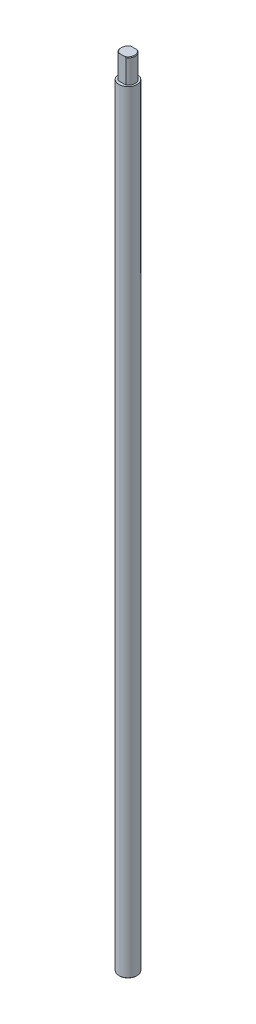
ISO-10303-21;
HEADER;
FILE_DESCRIPTION(('STEP AP214'),'2;1');
FILE_NAME('part.step','',(''),(''),'','','');
FILE_SCHEMA(('AUTOMOTIVE_DESIGN { 1 0 10303 214 1 1 1 1 }'));
ENDSEC;
DATA;
#1=APPLICATION_CONTEXT('core data for automotive mechanical design processes');
#2=APPLICATION_PROTOCOL_DEFINITION('international standard','automotive_design',2000,#1);
#3=PRODUCT_CONTEXT('',#1,'mechanical');
#4=PRODUCT('Part','Part','',(#3));
#5=PRODUCT_RELATED_PRODUCT_CATEGORY('part','',(#4));
#6=PRODUCT_DEFINITION_FORMATION('','',#4);
#7=PRODUCT_DEFINITION_CONTEXT('part definition',#1,'design');
#8=PRODUCT_DEFINITION('design','',#6,#7);
#9=PRODUCT_DEFINITION_SHAPE('','',#8);
#10=(LENGTH_UNIT() NAMED_UNIT(*) SI_UNIT(.MILLI.,.METRE.));
#11=(NAMED_UNIT(*) PLANE_ANGLE_UNIT() SI_UNIT($,.RADIAN.));
#12=(NAMED_UNIT(*) SI_UNIT($,.STERADIAN.) SOLID_ANGLE_UNIT());
#13=UNCERTAINTY_MEASURE_WITH_UNIT(LENGTH_MEASURE(1.E-05),#10,'distance_accuracy_value','');
#14=(GEOMETRIC_REPRESENTATION_CONTEXT(3) GLOBAL_UNCERTAINTY_ASSIGNED_CONTEXT((#13)) GLOBAL_UNIT_ASSIGNED_CONTEXT((#10,
#11,#12)) REPRESENTATION_CONTEXT('',''));
#15=CARTESIAN_POINT('',(0.,0.,0.));
#16=DIRECTION('',(0.,0.,1.));
#17=DIRECTION('',(1.,0.,0.));
#18=AXIS2_PLACEMENT_3D('',#15,#16,#17);
#19=CARTESIAN_POINT('',(0.,660.,0.));
#20=DIRECTION('',(0.,-1.,0.));
#21=DIRECTION('',(0.,0.,-1.));
#22=AXIS2_PLACEMENT_3D('',#19,#20,#21);
#23=CYLINDRICAL_SURFACE('',#22,6.);
#24=CARTESIAN_POINT('',(0.,659.5,0.));
#25=DIRECTION('',(0.,1.,0.));
#26=DIRECTION('',(0.,0.,1.));
#27=AXIS2_PLACEMENT_3D('',#24,#25,#26);
#28=CIRCLE('',#27,6.);
#29=CARTESIAN_POINT('',(3.3166247903554,659.5,-5.));
#30=VERTEX_POINT('',#29);
#31=CARTESIAN_POINT('',(3.3166247903554,659.5,5.));
#32=VERTEX_POINT('',#31);
#33=EDGE_CURVE('E123',#30,#32,#28,.F.);
#34=ORIENTED_EDGE('',*,*,#33,.T.);
#35=DIRECTION('',(0.,-1.,0.));
#36=VECTOR('',#35,1.);
#37=CARTESIAN_POINT('',(3.3166247903554,660.,5.));
#38=LINE('',#37,#36);
#39=CARTESIAN_POINT('',(3.3166247903554,640.,5.));
#40=VERTEX_POINT('',#39);
#41=EDGE_CURVE('E147',#32,#40,#38,.T.);
#42=ORIENTED_EDGE('',*,*,#41,.T.);
#43=CARTESIAN_POINT('',(0.,640.,0.));
#44=DIRECTION('',(0.,1.,0.));
#45=DIRECTION('',(0.,0.,1.));
#46=AXIS2_PLACEMENT_3D('',#43,#44,#45);
#47=CIRCLE('',#46,6.);
#48=CARTESIAN_POINT('',(3.3166247903554,640.,-5.));
#49=VERTEX_POINT('',#48);
#50=EDGE_CURVE('E107',#40,#49,#47,.T.);
#51=ORIENTED_EDGE('',*,*,#50,.T.);
#52=DIRECTION('',(0.,-1.,0.));
#53=VECTOR('',#52,1.);
#54=CARTESIAN_POINT('',(3.3166247903554,660.,-5.));
#55=LINE('',#54,#53);
#56=EDGE_CURVE('E116',#30,#49,#55,.T.);
#57=ORIENTED_EDGE('',*,*,#56,.F.);
#58=EDGE_LOOP('',(#34,#42,#51,#57));
#59=FACE_BOUND('',#58,.T.);
#60=ADVANCED_FACE('F34',(#59),#23,.T.);
#61=CARTESIAN_POINT('',(0.,660.,0.));
#62=DIRECTION('',(0.,-1.,0.));
#63=DIRECTION('',(0.,0.,-1.));
#64=AXIS2_PLACEMENT_3D('',#61,#62,#63);
#65=CONICAL_SURFACE('',#64,5.50000000000006,0.785398163397553);
#66=CARTESIAN_POINT('',(12.22334855983,652.293552710322,5.));
#67=CARTESIAN_POINT('',(12.0400029293376,652.463246960102,5.));
#68=CARTESIAN_POINT('',(11.8563878361384,652.632649947447,5.));
#69=CARTESIAN_POINT('',(11.4885378544732,652.970784231569,5.));
#70=CARTESIAN_POINT('',(11.3043029615145,653.139515523459,5.));
#71=CARTESIAN_POINT('',(10.7504718940034,653.644636813994,5.));
#72=CARTESIAN_POINT('',(10.3798281134268,653.979881169615,5.));
#73=CARTESIAN_POINT('',(9.63266719983616,654.648262236814,5.));
#74=CARTESIAN_POINT('',(9.2561282580727,654.981374605814,5.));
#75=CARTESIAN_POINT('',(8.49810204498104,655.641856916378,5.));
#76=CARTESIAN_POINT('',(8.11661535915403,655.969227526812,5.));
#77=CARTESIAN_POINT('',(7.42330230552387,656.551398459378,5.));
#78=CARTESIAN_POINT('',(7.11271954455886,656.807676939286,5.));
#79=CARTESIAN_POINT('',(6.48553211722527,657.312973305593,5.));
#80=CARTESIAN_POINT('',(6.16892602602592,657.561989437878,5.));
#81=CARTESIAN_POINT('',(5.68812727765436,657.927413526655,5.));
#82=CARTESIAN_POINT('',(5.52696677289516,658.047809604747,5.));
#83=CARTESIAN_POINT('',(5.20226568192582,658.285342435593,5.));
#84=CARTESIAN_POINT('',(5.03872520717697,658.40247934024,5.));
#85=CARTESIAN_POINT('',(4.70889969383424,658.632700889785,5.));
#86=CARTESIAN_POINT('',(4.54261572025751,658.74578705551,5.));
#87=CARTESIAN_POINT('',(4.20675664729495,658.966943969054,5.));
#88=CARTESIAN_POINT('',(4.03718191817055,659.075015276536,5.));
#89=CARTESIAN_POINT('',(3.69809120163237,659.282420084442,5.));
#90=CARTESIAN_POINT('',(3.52866368370528,659.381897440864,5.));
#91=CARTESIAN_POINT('',(3.18548204509233,659.573196878072,5.));
#92=CARTESIAN_POINT('',(3.01172744281381,659.66501810176,5.));
#93=CARTESIAN_POINT('',(2.65945234393679,659.838796436716,5.));
#94=CARTESIAN_POINT('',(2.48093507504249,659.920760031029,5.));
#95=CARTESIAN_POINT('',(2.11863259752753,660.072150310321,5.));
#96=CARTESIAN_POINT('',(1.93484890339067,660.141580558453,5.));
#97=CARTESIAN_POINT('',(1.60289228250908,660.251152279173,5.));
#98=CARTESIAN_POINT('',(1.45574319580293,660.294377843721,5.));
#99=CARTESIAN_POINT('',(1.15856686982226,660.369538898374,5.));
#100=CARTESIAN_POINT('',(1.00853999453272,660.401475806479,5.));
#101=CARTESIAN_POINT('',(0.706783929881227,660.452473936665,5.));
#102=CARTESIAN_POINT('',(0.555061860791687,660.471576682023,5.));
#103=CARTESIAN_POINT('',(0.250503200108504,660.496029034181,5.));
#104=CARTESIAN_POINT('',(0.0976666709722712,660.501379405849,5.));
#105=CARTESIAN_POINT('',(-0.208244141116066,660.498009252106,5.));
#106=CARTESIAN_POINT('',(-0.361318016945886,660.489252306756,5.));
#107=CARTESIAN_POINT('',(-0.666062012433062,660.45811073959,5.));
#108=CARTESIAN_POINT('',(-0.817732018922314,660.435725028685,5.));
#109=CARTESIAN_POINT('',(-1.11914220224536,660.378427857741,5.));
#110=CARTESIAN_POINT('',(-1.26887489503792,660.343477593186,5.));
#111=CARTESIAN_POINT('',(-1.56532579810628,660.262644710564,5.));
#112=CARTESIAN_POINT('',(-1.71204388153633,660.216761633497,5.));
#113=CARTESIAN_POINT('',(-2.0196471318203,660.109661269655,5.));
#114=CARTESIAN_POINT('',(-2.18011816259035,660.047264297467,5.));
#115=CARTESIAN_POINT('',(-2.49705485153894,659.912991711146,5.));
#116=CARTESIAN_POINT('',(-2.65351926483484,659.8411131927,5.));
#117=CARTESIAN_POINT('',(-2.96295005207016,659.689591818967,5.));
#118=CARTESIAN_POINT('',(-3.11590988974211,659.609935716037,5.));
#119=CARTESIAN_POINT('',(-3.4184131850314,659.44446350195,5.));
#120=CARTESIAN_POINT('',(-3.56795707797578,659.35864818156,5.));
#121=CARTESIAN_POINT('',(-3.86590244281311,659.180923853313,5.));
#122=CARTESIAN_POINT('',(-4.0142663447522,659.088952144972,5.));
#123=CARTESIAN_POINT('',(-4.30832123919002,658.900841703968,5.));
#124=CARTESIAN_POINT('',(-4.45401216994038,658.804702875212,5.));
#125=CARTESIAN_POINT('',(-4.88733363254318,658.511391564202,5.));
#126=CARTESIAN_POINT('',(-5.17152122052706,658.309135998796,5.));
#127=CARTESIAN_POINT('',(-5.76012033076529,657.875315695957,5.));
#128=CARTESIAN_POINT('',(-6.06382929903634,657.642808257487,5.));
#129=CARTESIAN_POINT('',(-6.66512501044532,657.169965983154,5.));
#130=CARTESIAN_POINT('',(-6.96271095674996,656.929630138904,5.));
#131=CARTESIAN_POINT('',(-7.55348793274173,656.44311737348,5.));
#132=CARTESIAN_POINT('',(-7.84667488271747,656.196935518402,5.));
#133=CARTESIAN_POINT('',(-8.42947120866817,655.700370127563,5.));
#134=CARTESIAN_POINT('',(-8.71908050419196,655.449986497614,5.));
#135=CARTESIAN_POINT('',(-9.27941208066306,654.96007248106,5.));
#136=CARTESIAN_POINT('',(-9.55028664788322,654.720715922638,5.));
#137=CARTESIAN_POINT('',(-10.0900218062732,654.23973516699,5.));
#138=CARTESIAN_POINT('',(-10.3588823600943,653.998110927899,5.));
#139=CARTESIAN_POINT('',(-10.8944553227108,653.513501244727,5.));
#140=CARTESIAN_POINT('',(-11.1611708151752,653.270519204575,5.));
#141=CARTESIAN_POINT('',(-11.6932230428826,652.783071863564,5.));
#142=CARTESIAN_POINT('',(-11.9585598350719,652.538606624886,5.));
#143=CARTESIAN_POINT('',(-12.22334855983,652.293552710322,5.));
#144=B_SPLINE_CURVE_WITH_KNOTS('',3,(#66,#67,#68,#69,#70,#71,#72,#73,#74,#75,#76,#77,#78,#79,
#80,#81,#82,#83,#84,#85,#86,#87,#88,#89,#90,#91,#92,#93,#94,#95,#96,#97,#98,#99,#100,#101,#102,
#103,#104,#105,#106,#107,#108,#109,#110,#111,#112,#113,#114,#115,#116,#117,#118,#119,#120,#121,
#122,#123,#124,#125,#126,#127,#128,#129,#130,#131,#132,#133,#134,#135,#136,#137,#138,#139,#140,
#141,#142,#143),.UNSPECIFIED.,.F.,.F.,(4,2,2,2,2,2,2,2,2,2,2,2,2,2,2,2,2,2,2,2,2,2,2,2,2,2,2,2,
2,2,2,2,2,2,2,2,2,2,4),(0.,0.749469643571852,1.49894473141827,2.9982172300205,4.50639406423934,
6.01439402488847,7.2223248269339,8.43054501058047,9.03401301569174,9.63745284892465,
10.2406636973512,10.8438070641905,11.4330691369915,12.0223970887689,12.6113353141594,
13.2001058434129,13.6598288252792,14.1194940394927,14.5776648108287,15.0358100993938,
15.4951400482719,15.9545067075062,16.4153044430763,16.8761215280954,17.39226830377,
17.9085735502184,18.4257740976825,18.9429083613183,19.466498689817,19.9901010985979,
21.0362232391769,22.1835295246974,23.3309841850491,24.479444343396,25.6279302804764,
26.7123418143405,27.7967734083916,28.8791706369451,29.9615227966657),.UNSPECIFIED.);
#145=CARTESIAN_POINT('',(2.29128784747806,660.,5.));
#146=VERTEX_POINT('',#145);
#147=EDGE_CURVE('E98',#32,#146,#144,.T.);
#148=ORIENTED_EDGE('',*,*,#147,.F.);
#149=ORIENTED_EDGE('',*,*,#33,.F.);
#150=CARTESIAN_POINT('',(12.22334855983,652.293552710322,-5.));
#151=CARTESIAN_POINT('',(12.0400029293376,652.463246960102,-5.));
#152=CARTESIAN_POINT('',(11.8563878361384,652.632649947447,-5.));
#153=CARTESIAN_POINT('',(11.4885378544732,652.970784231569,-5.));
#154=CARTESIAN_POINT('',(11.3043029615145,653.139515523459,-5.));
#155=CARTESIAN_POINT('',(10.7504718940034,653.644636813994,-5.));
#156=CARTESIAN_POINT('',(10.3798281134268,653.979881169615,-5.));
#157=CARTESIAN_POINT('',(9.63266719983616,654.648262236814,-5.));
#158=CARTESIAN_POINT('',(9.2561282580727,654.981374605814,-5.));
#159=CARTESIAN_POINT('',(8.49810204498104,655.641856916378,-5.));
#160=CARTESIAN_POINT('',(8.11661535915403,655.969227526812,-5.));
#161=CARTESIAN_POINT('',(7.42330230552387,656.551398459378,-5.));
#162=CARTESIAN_POINT('',(7.11271954455886,656.807676939286,-5.));
#163=CARTESIAN_POINT('',(6.48553211722527,657.312973305593,-5.));
#164=CARTESIAN_POINT('',(6.16892602602592,657.561989437878,-5.));
#165=CARTESIAN_POINT('',(5.68812727765436,657.927413526655,-5.));
#166=CARTESIAN_POINT('',(5.52696677289516,658.047809604747,-5.));
#167=CARTESIAN_POINT('',(5.20226568192582,658.285342435593,-5.));
#168=CARTESIAN_POINT('',(5.03872520717697,658.40247934024,-5.));
#169=CARTESIAN_POINT('',(4.70889969383424,658.632700889785,-5.));
#170=CARTESIAN_POINT('',(4.54261572025751,658.74578705551,-5.));
#171=CARTESIAN_POINT('',(4.20675664729495,658.966943969054,-5.));
#172=CARTESIAN_POINT('',(4.03718191817055,659.075015276536,-5.));
#173=CARTESIAN_POINT('',(3.69809120163237,659.282420084442,-5.));
#174=CARTESIAN_POINT('',(3.52866368370528,659.381897440864,-5.));
#175=CARTESIAN_POINT('',(3.18548204509233,659.573196878072,-5.));
#176=CARTESIAN_POINT('',(3.01172744281381,659.66501810176,-5.));
#177=CARTESIAN_POINT('',(2.65945234393679,659.838796436716,-5.));
#178=CARTESIAN_POINT('',(2.48093507504249,659.920760031029,-5.));
#179=CARTESIAN_POINT('',(2.11863259752753,660.072150310321,-5.));
#180=CARTESIAN_POINT('',(1.93484890339067,660.141580558453,-5.));
#181=CARTESIAN_POINT('',(1.60289228250908,660.251152279173,-5.));
#182=CARTESIAN_POINT('',(1.45574319580293,660.294377843721,-5.));
#183=CARTESIAN_POINT('',(1.15856686982226,660.369538898374,-5.));
#184=CARTESIAN_POINT('',(1.00853999453272,660.401475806479,-5.));
#185=CARTESIAN_POINT('',(0.706783929881227,660.452473936665,-5.));
#186=CARTESIAN_POINT('',(0.555061860791687,660.471576682023,-5.));
#187=CARTESIAN_POINT('',(0.250503200108504,660.496029034181,-5.));
#188=CARTESIAN_POINT('',(0.0976666709722712,660.501379405849,-5.));
#189=CARTESIAN_POINT('',(-0.208244141116066,660.498009252106,-5.));
#190=CARTESIAN_POINT('',(-0.361318016945886,660.489252306756,-5.));
#191=CARTESIAN_POINT('',(-0.666062012433062,660.45811073959,-5.));
#192=CARTESIAN_POINT('',(-0.817732018922314,660.435725028685,-5.));
#193=CARTESIAN_POINT('',(-1.11914220224536,660.378427857741,-5.));
#194=CARTESIAN_POINT('',(-1.26887489503792,660.343477593186,-5.));
#195=CARTESIAN_POINT('',(-1.56532579810628,660.262644710564,-5.));
#196=CARTESIAN_POINT('',(-1.71204388153633,660.216761633497,-5.));
#197=CARTESIAN_POINT('',(-2.0196471318203,660.109661269655,-5.));
#198=CARTESIAN_POINT('',(-2.18011816259035,660.047264297467,-5.));
#199=CARTESIAN_POINT('',(-2.49705485153894,659.912991711146,-5.));
#200=CARTESIAN_POINT('',(-2.65351926483484,659.8411131927,-5.));
#201=CARTESIAN_POINT('',(-2.96295005207016,659.689591818967,-5.));
#202=CARTESIAN_POINT('',(-3.11590988974211,659.609935716037,-5.));
#203=CARTESIAN_POINT('',(-3.4184131850314,659.44446350195,-5.));
#204=CARTESIAN_POINT('',(-3.56795707797578,659.35864818156,-5.));
#205=CARTESIAN_POINT('',(-3.86590244281311,659.180923853313,-5.));
#206=CARTESIAN_POINT('',(-4.0142663447522,659.088952144972,-5.));
#207=CARTESIAN_POINT('',(-4.30832123919002,658.900841703968,-5.));
#208=CARTESIAN_POINT('',(-4.45401216994038,658.804702875212,-5.));
#209=CARTESIAN_POINT('',(-4.88733363254318,658.511391564202,-5.));
#210=CARTESIAN_POINT('',(-5.17152122052706,658.309135998796,-5.));
#211=CARTESIAN_POINT('',(-5.76012033076529,657.875315695957,-5.));
#212=CARTESIAN_POINT('',(-6.06382929903634,657.642808257487,-5.));
#213=CARTESIAN_POINT('',(-6.66512501044532,657.169965983154,-5.));
#214=CARTESIAN_POINT('',(-6.96271095674996,656.929630138904,-5.));
#215=CARTESIAN_POINT('',(-7.55348793274173,656.44311737348,-5.));
#216=CARTESIAN_POINT('',(-7.84667488271747,656.196935518402,-5.));
#217=CARTESIAN_POINT('',(-8.42947120866817,655.700370127563,-5.));
#218=CARTESIAN_POINT('',(-8.71908050419196,655.449986497614,-5.));
#219=CARTESIAN_POINT('',(-9.27941208066306,654.96007248106,-5.));
#220=CARTESIAN_POINT('',(-9.55028664788322,654.720715922638,-5.));
#221=CARTESIAN_POINT('',(-10.0900218062732,654.23973516699,-5.));
#222=CARTESIAN_POINT('',(-10.3588823600943,653.998110927899,-5.));
#223=CARTESIAN_POINT('',(-10.8944553227108,653.513501244727,-5.));
#224=CARTESIAN_POINT('',(-11.1611708151752,653.270519204575,-5.));
#225=CARTESIAN_POINT('',(-11.6932230428826,652.783071863564,-5.));
#226=CARTESIAN_POINT('',(-11.9585598350719,652.538606624886,-5.));
#227=CARTESIAN_POINT('',(-12.22334855983,652.293552710322,-5.));
#228=B_SPLINE_CURVE_WITH_KNOTS('',3,(#150,#151,#152,#153,#154,#155,#156,#157,#158,#159,#160,
#161,#162,#163,#164,#165,#166,#167,#168,#169,#170,#171,#172,#173,#174,#175,#176,#177,#178,#179,
#180,#181,#182,#183,#184,#185,#186,#187,#188,#189,#190,#191,#192,#193,#194,#195,#196,#197,#198,
#199,#200,#201,#202,#203,#204,#205,#206,#207,#208,#209,#210,#211,#212,#213,#214,#215,#216,#217,
#218,#219,#220,#221,#222,#223,#224,#225,#226,#227),.UNSPECIFIED.,.F.,.F.,(4,2,2,2,2,2,2,2,2,2,2,
2,2,2,2,2,2,2,2,2,2,2,2,2,2,2,2,2,2,2,2,2,2,2,2,2,2,2,4),(0.,0.749469643571852,1.49894473141827,
2.9982172300205,4.50639406423934,6.01439402488847,7.2223248269339,8.43054501058047,
9.03401301569174,9.63745284892465,10.2406636973512,10.8438070641905,11.4330691369915,
12.0223970887689,12.6113353141594,13.2001058434129,13.6598288252792,14.1194940394927,
14.5776648108287,15.0358100993938,15.4951400482719,15.9545067075062,16.4153044430763,
16.8761215280954,17.39226830377,17.9085735502184,18.4257740976825,18.9429083613183,
19.466498689817,19.9901010985979,21.0362232391769,22.1835295246974,23.3309841850491,
24.479444343396,25.6279302804764,26.7123418143405,27.7967734083916,28.8791706369451,
29.9615227966657),.UNSPECIFIED.);
#229=CARTESIAN_POINT('',(2.29128784747806,660.,-5.));
#230=VERTEX_POINT('',#229);
#231=EDGE_CURVE('E11',#30,#230,#228,.T.);
#232=ORIENTED_EDGE('',*,*,#231,.T.);
#233=CARTESIAN_POINT('',(0.,660.,0.));
#234=DIRECTION('',(0.,1.,0.));
#235=DIRECTION('',(0.,0.,1.));
#236=AXIS2_PLACEMENT_3D('',#233,#234,#235);
#237=CIRCLE('',#236,5.50000000000006);
#238=EDGE_CURVE('E114',#146,#230,#237,.T.);
#239=ORIENTED_EDGE('',*,*,#238,.F.);
#240=EDGE_LOOP('',(#148,#149,#232,#239));
#241=FACE_BOUND('',#240,.T.);
#242=ADVANCED_FACE('F168',(#241),#65,.T.);
#243=CARTESIAN_POINT('',(-3.3166247903554,640.,-5.));
#244=VERTEX_POINT('',#243);
#245=CARTESIAN_POINT('',(-3.3166247903554,640.,5.));
#246=VERTEX_POINT('',#245);
#247=EDGE_CURVE('E106',#244,#246,#47,.T.);
#248=ORIENTED_EDGE('',*,*,#247,.T.);
#249=DIRECTION('',(0.,-1.,0.));
#250=VECTOR('',#249,1.);
#251=CARTESIAN_POINT('',(-3.3166247903554,660.,5.));
#252=LINE('',#251,#250);
#253=CARTESIAN_POINT('',(-3.3166247903554,659.5,5.));
#254=VERTEX_POINT('',#253);
#255=EDGE_CURVE('E91',#246,#254,#252,.F.);
#256=ORIENTED_EDGE('',*,*,#255,.T.);
#257=CARTESIAN_POINT('',(-3.3166247903554,659.5,-5.));
#258=VERTEX_POINT('',#257);
#259=EDGE_CURVE('E62',#254,#258,#28,.F.);
#260=ORIENTED_EDGE('',*,*,#259,.T.);
#261=DIRECTION('',(0.,-1.,0.));
#262=VECTOR('',#261,1.);
#263=CARTESIAN_POINT('',(-3.3166247903554,660.,-5.));
#264=LINE('',#263,#262);
#265=EDGE_CURVE('E110',#244,#258,#264,.F.);
#266=ORIENTED_EDGE('',*,*,#265,.F.);
#267=EDGE_LOOP('',(#248,#256,#260,#266));
#268=FACE_BOUND('',#267,.T.);
#269=ADVANCED_FACE('F109',(#268),#23,.T.);
#270=CARTESIAN_POINT('',(0.,660.,0.));
#271=DIRECTION('',(0.,1.,0.));
#272=DIRECTION('',(0.,0.,1.));
#273=AXIS2_PLACEMENT_3D('',#270,#271,#272);
#274=PLANE('',#273);
#275=DIRECTION('',(-1.,0.,0.));
#276=VECTOR('',#275,1.);
#277=CARTESIAN_POINT('',(0.,660.,5.));
#278=LINE('',#277,#276);
#279=CARTESIAN_POINT('',(-2.29128784747806,660.,5.));
#280=VERTEX_POINT('',#279);
#281=EDGE_CURVE('E54',#146,#280,#278,.T.);
#282=ORIENTED_EDGE('',*,*,#281,.F.);
#283=ORIENTED_EDGE('',*,*,#238,.T.);
#284=DIRECTION('',(-1.,0.,0.));
#285=VECTOR('',#284,1.);
#286=CARTESIAN_POINT('',(0.,660.,-5.));
#287=LINE('',#286,#285);
#288=CARTESIAN_POINT('',(-2.29128784747806,660.,-5.));
#289=VERTEX_POINT('',#288);
#290=EDGE_CURVE('E141',#230,#289,#287,.T.);
#291=ORIENTED_EDGE('',*,*,#290,.T.);
#292=EDGE_CURVE('E120',#289,#280,#237,.T.);
#293=ORIENTED_EDGE('',*,*,#292,.T.);
#294=EDGE_LOOP('',(#282,#283,#291,#293));
#295=FACE_BOUND('',#294,.T.);
#296=ADVANCED_FACE('F143',(#295),#274,.T.);
#297=EDGE_CURVE('E96',#280,#254,#144,.T.);
#298=ORIENTED_EDGE('',*,*,#297,.F.);
#299=ORIENTED_EDGE('',*,*,#292,.F.);
#300=EDGE_CURVE('E38',#289,#258,#228,.T.);
#301=ORIENTED_EDGE('',*,*,#300,.T.);
#302=ORIENTED_EDGE('',*,*,#259,.F.);
#303=EDGE_LOOP('',(#298,#299,#301,#302));
#304=FACE_BOUND('',#303,.T.);
#305=ADVANCED_FACE('F135',(#304),#65,.T.);
#306=CARTESIAN_POINT('',(0.,640.,0.));
#307=DIRECTION('',(0.,1.,0.));
#308=DIRECTION('',(0.,0.,1.));
#309=AXIS2_PLACEMENT_3D('',#306,#307,#308);
#310=PLANE('',#309);
#311=ORIENTED_EDGE('',*,*,#50,.F.);
#312=DIRECTION('',(1.,0.,0.));
#313=VECTOR('',#312,1.);
#314=CARTESIAN_POINT('',(-7.5,640.,5.));
#315=LINE('',#314,#313);
#316=EDGE_CURVE('E94',#246,#40,#315,.T.);
#317=ORIENTED_EDGE('',*,*,#316,.F.);
#318=ORIENTED_EDGE('',*,*,#247,.F.);
#319=DIRECTION('',(1.,0.,0.));
#320=VECTOR('',#319,1.);
#321=CARTESIAN_POINT('',(-7.5,640.,-5.));
#322=LINE('',#321,#320);
#323=EDGE_CURVE('E145',#244,#49,#322,.T.);
#324=ORIENTED_EDGE('',*,*,#323,.T.);
#325=EDGE_LOOP('',(#311,#317,#318,#324));
#326=FACE_BOUND('',#325,.T.);
#327=CARTESIAN_POINT('',(0.,640.,0.));
#328=DIRECTION('',(0.,1.,0.));
#329=DIRECTION('',(0.,0.,1.));
#330=AXIS2_PLACEMENT_3D('',#327,#328,#329);
#331=CIRCLE('',#330,7.5);
#332=CARTESIAN_POINT('',(0.,640.,7.5));
#333=VERTEX_POINT('',#332);
#334=EDGE_CURVE('E111',#333,#333,#331,.T.);
#335=ORIENTED_EDGE('',*,*,#334,.T.);
#336=EDGE_LOOP('',(#335));
#337=FACE_BOUND('',#336,.T.);
#338=ADVANCED_FACE('F103',(#326,#337),#310,.T.);
#339=CARTESIAN_POINT('',(0.,640.,0.));
#340=DIRECTION('',(0.,-1.,0.));
#341=DIRECTION('',(0.,0.,-1.));
#342=AXIS2_PLACEMENT_3D('',#339,#340,#341);
#343=CYLINDRICAL_SURFACE('',#342,7.5);
#344=CARTESIAN_POINT('',(0.,0.499999999999945,0.));
#345=DIRECTION('',(0.,1.,0.));
#346=DIRECTION('',(0.,0.,1.));
#347=AXIS2_PLACEMENT_3D('',#344,#345,#346);
#348=CIRCLE('',#347,7.5);
#349=CARTESIAN_POINT('',(0.,0.499999999999945,7.5));
#350=VERTEX_POINT('',#349);
#351=EDGE_CURVE('E126',#350,#350,#348,.T.);
#352=ORIENTED_EDGE('',*,*,#351,.T.);
#353=EDGE_LOOP('',(#352));
#354=FACE_BOUND('',#353,.T.);
#355=ORIENTED_EDGE('',*,*,#334,.F.);
#356=EDGE_LOOP('',(#355));
#357=FACE_BOUND('',#356,.T.);
#358=ADVANCED_FACE('F171',(#354,#357),#343,.T.);
#359=CARTESIAN_POINT('',(0.,0.,0.));
#360=DIRECTION('',(0.,1.,0.));
#361=DIRECTION('',(0.,0.,1.));
#362=AXIS2_PLACEMENT_3D('',#359,#360,#361);
#363=PLANE('',#362);
#364=CARTESIAN_POINT('',(0.,0.,0.));
#365=DIRECTION('',(0.,1.,0.));
#366=DIRECTION('',(0.,0.,1.));
#367=AXIS2_PLACEMENT_3D('',#364,#365,#366);
#368=CIRCLE('',#367,7.00000000000006);
#369=CARTESIAN_POINT('',(0.,0.,7.00000000000006));
#370=VERTEX_POINT('',#369);
#371=EDGE_CURVE('E128',#370,#370,#368,.F.);
#372=ORIENTED_EDGE('',*,*,#371,.T.);
#373=EDGE_LOOP('',(#372));
#374=FACE_BOUND('',#373,.T.);
#375=ADVANCED_FACE('F172',(#374),#363,.F.);
#376=CARTESIAN_POINT('',(0.,0.499999999999945,0.));
#377=DIRECTION('',(0.,1.,0.));
#378=DIRECTION('',(0.,0.,1.));
#379=AXIS2_PLACEMENT_3D('',#376,#377,#378);
#380=CONICAL_SURFACE('',#379,7.5,0.785398163397442);
#381=ORIENTED_EDGE('',*,*,#371,.F.);
#382=EDGE_LOOP('',(#381));
#383=FACE_BOUND('',#382,.T.);
#384=ORIENTED_EDGE('',*,*,#351,.F.);
#385=EDGE_LOOP('',(#384));
#386=FACE_BOUND('',#385,.T.);
#387=ADVANCED_FACE('F36',(#383,#386),#380,.T.);
#388=CARTESIAN_POINT('',(-7.5,0.,-5.));
#389=DIRECTION('',(0.,0.,-1.));
#390=DIRECTION('',(-1.,0.,0.));
#391=AXIS2_PLACEMENT_3D('',#388,#389,#390);
#392=PLANE('',#391);
#393=ORIENTED_EDGE('',*,*,#56,.T.);
#394=ORIENTED_EDGE('',*,*,#323,.F.);
#395=ORIENTED_EDGE('',*,*,#265,.T.);
#396=ORIENTED_EDGE('',*,*,#300,.F.);
#397=ORIENTED_EDGE('',*,*,#290,.F.);
#398=ORIENTED_EDGE('',*,*,#231,.F.);
#399=EDGE_LOOP('',(#393,#394,#395,#396,#397,#398));
#400=FACE_BOUND('',#399,.T.);
#401=ADVANCED_FACE('F140',(#400),#392,.T.);
#402=CARTESIAN_POINT('',(-7.5,0.,5.));
#403=DIRECTION('',(0.,0.,-1.));
#404=DIRECTION('',(-1.,0.,0.));
#405=AXIS2_PLACEMENT_3D('',#402,#403,#404);
#406=PLANE('',#405);
#407=ORIENTED_EDGE('',*,*,#147,.T.);
#408=ORIENTED_EDGE('',*,*,#281,.T.);
#409=ORIENTED_EDGE('',*,*,#297,.T.);
#410=ORIENTED_EDGE('',*,*,#255,.F.);
#411=ORIENTED_EDGE('',*,*,#316,.T.);
#412=ORIENTED_EDGE('',*,*,#41,.F.);
#413=EDGE_LOOP('',(#407,#408,#409,#410,#411,#412));
#414=FACE_BOUND('',#413,.T.);
#415=ADVANCED_FACE('F93',(#414),#406,.F.);
#416=CLOSED_SHELL('',(#60,#242,#269,#296,#305,#338,#358,#375,#387,#401,#415));
#417=MANIFOLD_SOLID_BREP('B2',#416);
#418=ADVANCED_BREP_SHAPE_REPRESENTATION('',(#18,#417),#14);
#419=SHAPE_DEFINITION_REPRESENTATION(#9,#418);
ENDSEC;
END-ISO-10303-21;
